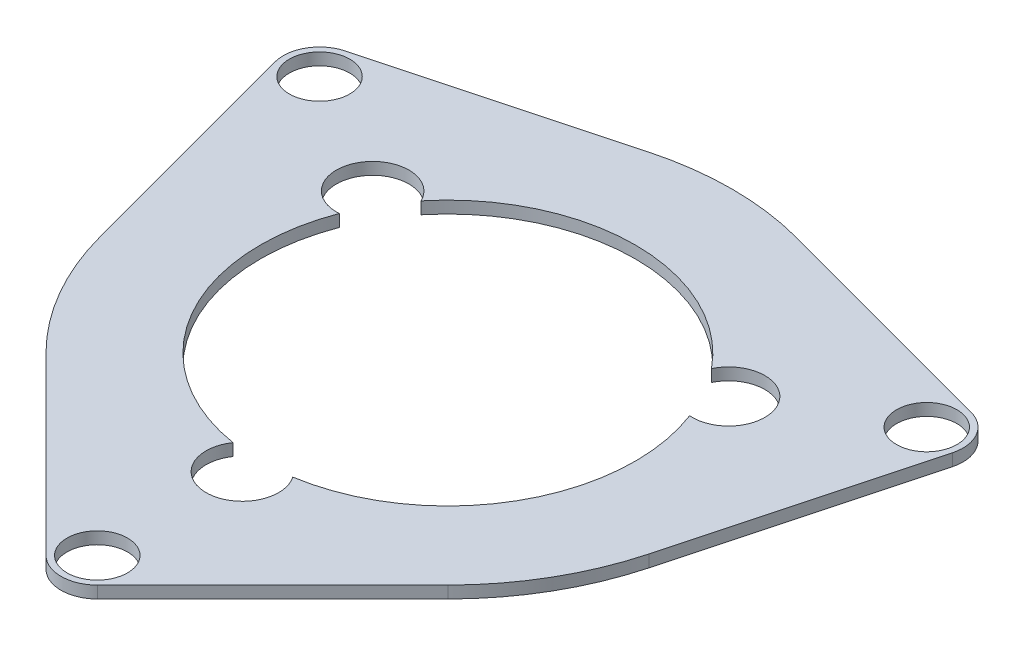
ISO-10303-21;
HEADER;
FILE_DESCRIPTION(('STEP AP214'),'2;1');
FILE_NAME('part.step','',(''),(''),'','','');
FILE_SCHEMA(('AUTOMOTIVE_DESIGN { 1 0 10303 214 1 1 1 1 }'));
ENDSEC;
DATA;
#1=APPLICATION_CONTEXT('core data for automotive mechanical design processes');
#2=APPLICATION_PROTOCOL_DEFINITION('international standard','automotive_design',2000,#1);
#3=PRODUCT_CONTEXT('',#1,'mechanical');
#4=PRODUCT('Part','Part','',(#3));
#5=PRODUCT_RELATED_PRODUCT_CATEGORY('part','',(#4));
#6=PRODUCT_DEFINITION_FORMATION('','',#4);
#7=PRODUCT_DEFINITION_CONTEXT('part definition',#1,'design');
#8=PRODUCT_DEFINITION('design','',#6,#7);
#9=PRODUCT_DEFINITION_SHAPE('','',#8);
#10=(LENGTH_UNIT() NAMED_UNIT(*) SI_UNIT(.MILLI.,.METRE.));
#11=(NAMED_UNIT(*) PLANE_ANGLE_UNIT() SI_UNIT($,.RADIAN.));
#12=(NAMED_UNIT(*) SI_UNIT($,.STERADIAN.) SOLID_ANGLE_UNIT());
#13=UNCERTAINTY_MEASURE_WITH_UNIT(LENGTH_MEASURE(1.E-05),#10,'distance_accuracy_value','');
#14=(GEOMETRIC_REPRESENTATION_CONTEXT(3) GLOBAL_UNCERTAINTY_ASSIGNED_CONTEXT((#13)) GLOBAL_UNIT_ASSIGNED_CONTEXT((#10,
#11,#12)) REPRESENTATION_CONTEXT('',''));
#15=CARTESIAN_POINT('',(0.,0.,0.));
#16=DIRECTION('',(0.,0.,1.));
#17=DIRECTION('',(1.,0.,0.));
#18=AXIS2_PLACEMENT_3D('',#15,#16,#17);
#19=CARTESIAN_POINT('',(0.,0.5,0.));
#20=DIRECTION('',(0.,-1.,0.));
#21=DIRECTION('',(0.,0.,-1.));
#22=AXIS2_PLACEMENT_3D('',#19,#20,#21);
#23=PLANE('',#22);
#24=CARTESIAN_POINT('',(0.,0.5,14.4999999999999));
#25=DIRECTION('',(0.,1.,0.));
#26=DIRECTION('',(0.,0.,1.));
#27=AXIS2_PLACEMENT_3D('',#24,#25,#26);
#28=CIRCLE('',#27,1.25);
#29=CARTESIAN_POINT('',(0.,0.5,15.7499999999999));
#30=VERTEX_POINT('',#29);
#31=EDGE_CURVE('E206',#30,#30,#28,.T.);
#32=ORIENTED_EDGE('',*,*,#31,.F.);
#33=EDGE_LOOP('',(#32));
#34=FACE_BOUND('',#33,.T.);
#35=CARTESIAN_POINT('',(-12.5573683548744,0.5,-7.24999999999988));
#36=DIRECTION('',(0.,1.,0.));
#37=DIRECTION('',(0.,0.,1.));
#38=AXIS2_PLACEMENT_3D('',#35,#36,#37);
#39=CIRCLE('',#38,1.25);
#40=CARTESIAN_POINT('',(-12.5573683548744,0.5,-5.99999999999988));
#41=VERTEX_POINT('',#40);
#42=EDGE_CURVE('E218',#41,#41,#39,.T.);
#43=ORIENTED_EDGE('',*,*,#42,.F.);
#44=EDGE_LOOP('',(#43));
#45=FACE_BOUND('',#44,.T.);
#46=CARTESIAN_POINT('',(0.,0.5,0.));
#47=DIRECTION('',(0.,1.,0.));
#48=DIRECTION('',(0.,0.,-1.));
#49=AXIS2_PLACEMENT_3D('',#46,#47,#48);
#50=CIRCLE('',#49,11.753048327205);
#51=CARTESIAN_POINT('',(3.0419127450911,0.5,-11.3525729168708));
#52=VERTEX_POINT('',#51);
#53=CARTESIAN_POINT('',(-3.0419127450911,0.5,-11.3525729168708));
#54=VERTEX_POINT('',#53);
#55=EDGE_CURVE('E224',#52,#54,#50,.T.);
#56=ORIENTED_EDGE('',*,*,#55,.T.);
#57=DIRECTION('',(-0.965925826289065,0.,0.258819045102533));
#58=VECTOR('',#57,1.);
#59=CARTESIAN_POINT('',(-3.0419127450911,0.5,-11.3525729168708));
#60=LINE('',#59,#58);
#61=CARTESIAN_POINT('',(-12.9455969225282,0.5,-8.69888873943348));
#62=VERTEX_POINT('',#61);
#63=EDGE_CURVE('E227',#54,#62,#60,.T.);
#64=ORIENTED_EDGE('',*,*,#63,.T.);
#65=CARTESIAN_POINT('',(-12.5573683548744,0.5,-7.24999999999988));
#66=DIRECTION('',(0.,1.,0.));
#67=DIRECTION('',(0.,0.,-1.));
#68=AXIS2_PLACEMENT_3D('',#65,#66,#67);
#69=CIRCLE('',#68,1.5);
#70=CARTESIAN_POINT('',(-14.006257094308,0.5,-6.86177143234609));
#71=VERTEX_POINT('',#70);
#72=EDGE_CURVE('E230',#62,#71,#69,.T.);
#73=ORIENTED_EDGE('',*,*,#72,.T.);
#74=DIRECTION('',(0.258819045102528,0.,0.965925826289066));
#75=VECTOR('',#74,1.);
#76=CARTESIAN_POINT('',(-11.3525729168708,0.5,3.04191274509105));
#77=LINE('',#76,#75);
#78=CARTESIAN_POINT('',(-11.3525729168708,0.5,3.04191274509105));
#79=VERTEX_POINT('',#78);
#80=EDGE_CURVE('E232',#71,#79,#77,.T.);
#81=ORIENTED_EDGE('',*,*,#80,.T.);
#82=CARTESIAN_POINT('',(0.,0.5,0.));
#83=DIRECTION('',(0.,1.,0.));
#84=DIRECTION('',(0.,0.,1.));
#85=AXIS2_PLACEMENT_3D('',#82,#83,#84);
#86=CIRCLE('',#85,11.753048327205);
#87=CARTESIAN_POINT('',(-8.31066017177983,0.5,8.31066017177985));
#88=VERTEX_POINT('',#87);
#89=EDGE_CURVE('E234',#79,#88,#86,.T.);
#90=ORIENTED_EDGE('',*,*,#89,.T.);
#91=DIRECTION('',(0.707106781186549,0.,0.707106781186546));
#92=VECTOR('',#91,1.);
#93=CARTESIAN_POINT('',(-8.31066017177982,0.5,8.31066017177985));
#94=LINE('',#93,#92);
#95=CARTESIAN_POINT('',(-1.06066017177982,0.5,15.5606601717798));
#96=VERTEX_POINT('',#95);
#97=EDGE_CURVE('E236',#88,#96,#94,.T.);
#98=ORIENTED_EDGE('',*,*,#97,.T.);
#99=CARTESIAN_POINT('',(0.,0.5,14.4999999999999));
#100=DIRECTION('',(0.,1.,0.));
#101=DIRECTION('',(0.,0.,1.));
#102=AXIS2_PLACEMENT_3D('',#99,#100,#101);
#103=CIRCLE('',#102,1.50000000000005);
#104=CARTESIAN_POINT('',(1.06066017177982,0.5,15.5606601717798));
#105=VERTEX_POINT('',#104);
#106=EDGE_CURVE('E238',#96,#105,#103,.T.);
#107=ORIENTED_EDGE('',*,*,#106,.T.);
#108=DIRECTION('',(0.707106781186548,0.,-0.707106781186547));
#109=VECTOR('',#108,1.);
#110=CARTESIAN_POINT('',(8.31066017177982,0.5,8.31066017177985));
#111=LINE('',#110,#109);
#112=CARTESIAN_POINT('',(8.31066017177982,0.5,8.31066017177985));
#113=VERTEX_POINT('',#112);
#114=EDGE_CURVE('E240',#105,#113,#111,.T.);
#115=ORIENTED_EDGE('',*,*,#114,.T.);
#116=CARTESIAN_POINT('',(0.,0.5,0.));
#117=DIRECTION('',(0.,1.,0.));
#118=DIRECTION('',(0.,0.,-1.));
#119=AXIS2_PLACEMENT_3D('',#116,#117,#118);
#120=CIRCLE('',#119,11.753048327205);
#121=CARTESIAN_POINT('',(11.3525729168708,0.5,3.04191274509105));
#122=VERTEX_POINT('',#121);
#123=EDGE_CURVE('E242',#113,#122,#120,.T.);
#124=ORIENTED_EDGE('',*,*,#123,.T.);
#125=DIRECTION('',(0.258819045102527,0.,-0.965925826289067));
#126=VECTOR('',#125,1.);
#127=CARTESIAN_POINT('',(11.3525729168708,0.5,3.04191274509105));
#128=LINE('',#127,#126);
#129=CARTESIAN_POINT('',(14.006257094308,0.5,-6.8617714323461));
#130=VERTEX_POINT('',#129);
#131=EDGE_CURVE('E244',#122,#130,#128,.T.);
#132=ORIENTED_EDGE('',*,*,#131,.T.);
#133=CARTESIAN_POINT('',(12.5573683548744,0.5,-7.24999999999991));
#134=DIRECTION('',(0.,1.,0.));
#135=DIRECTION('',(0.,0.,-1.));
#136=AXIS2_PLACEMENT_3D('',#133,#134,#135);
#137=CIRCLE('',#136,1.49999999999999);
#138=CARTESIAN_POINT('',(12.9455969225282,0.5,-8.69888873943349));
#139=VERTEX_POINT('',#138);
#140=EDGE_CURVE('E246',#130,#139,#137,.T.);
#141=ORIENTED_EDGE('',*,*,#140,.T.);
#142=DIRECTION('',(-0.965925826289065,0.,-0.258819045102532));
#143=VECTOR('',#142,1.);
#144=CARTESIAN_POINT('',(3.0419127450911,0.5,-11.3525729168708));
#145=LINE('',#144,#143);
#146=EDGE_CURVE('E248',#139,#52,#145,.T.);
#147=ORIENTED_EDGE('',*,*,#146,.T.);
#148=EDGE_LOOP('',(#56,#64,#73,#81,#90,#98,#107,#115,#124,#132,#141,#147));
#149=FACE_BOUND('',#148,.T.);
#150=CARTESIAN_POINT('',(12.5573683548744,0.5,-7.24999999999991));
#151=DIRECTION('',(0.,1.,0.));
#152=DIRECTION('',(0.,0.,1.));
#153=AXIS2_PLACEMENT_3D('',#150,#151,#152);
#154=CIRCLE('',#153,1.25);
#155=CARTESIAN_POINT('',(12.5573683548744,0.5,-5.99999999999991));
#156=VERTEX_POINT('',#155);
#157=EDGE_CURVE('E212',#156,#156,#154,.T.);
#158=ORIENTED_EDGE('',*,*,#157,.F.);
#159=EDGE_LOOP('',(#158));
#160=FACE_BOUND('',#159,.T.);
#161=CARTESIAN_POINT('',(0.,0.5,0.));
#162=DIRECTION('',(0.,1.,0.));
#163=DIRECTION('',(0.,0.,-1.));
#164=AXIS2_PLACEMENT_3D('',#161,#162,#163);
#165=CIRCLE('',#164,7.75);
#166=CARTESIAN_POINT('',(6.00751808071081,0.5,-4.89614404505553));
#167=VERTEX_POINT('',#166);
#168=CARTESIAN_POINT('',(-6.00751808071081,0.5,-4.89614404505553));
#169=VERTEX_POINT('',#168);
#170=EDGE_CURVE('E155',#167,#169,#165,.T.);
#171=ORIENTED_EDGE('',*,*,#170,.F.);
#172=CARTESIAN_POINT('',(7.36121593216777,0.5,-4.24999999999993));
#173=DIRECTION('',(0.,1.,0.));
#174=DIRECTION('',(0.,0.,-1.));
#175=AXIS2_PLACEMENT_3D('',#172,#173,#174);
#176=CIRCLE('',#175,1.5);
#177=CARTESIAN_POINT('',(7.24394416396144,0.5,-2.754591249062));
#178=VERTEX_POINT('',#177);
#179=EDGE_CURVE('E184',#178,#167,#176,.T.);
#180=ORIENTED_EDGE('',*,*,#179,.F.);
#181=CARTESIAN_POINT('',(0.,0.5,0.));
#182=DIRECTION('',(0.,1.,0.));
#183=DIRECTION('',(0.,0.,-1.));
#184=AXIS2_PLACEMENT_3D('',#181,#182,#183);
#185=CIRCLE('',#184,7.75);
#186=CARTESIAN_POINT('',(1.23642608325066,0.5,7.65073529411765));
#187=VERTEX_POINT('',#186);
#188=EDGE_CURVE('E182',#187,#178,#185,.T.);
#189=ORIENTED_EDGE('',*,*,#188,.F.);
#190=CARTESIAN_POINT('',(0.,0.5,8.5));
#191=DIRECTION('',(0.,1.,0.));
#192=DIRECTION('',(0.,0.,-1.));
#193=AXIS2_PLACEMENT_3D('',#190,#191,#192);
#194=CIRCLE('',#193,1.5);
#195=CARTESIAN_POINT('',(-1.23642608325065,0.5,7.65073529411765));
#196=VERTEX_POINT('',#195);
#197=EDGE_CURVE('E178',#196,#187,#194,.T.);
#198=ORIENTED_EDGE('',*,*,#197,.F.);
#199=CARTESIAN_POINT('',(0.,0.5,0.));
#200=DIRECTION('',(0.,1.,0.));
#201=DIRECTION('',(0.,0.,-1.));
#202=AXIS2_PLACEMENT_3D('',#199,#200,#201);
#203=CIRCLE('',#202,7.75);
#204=CARTESIAN_POINT('',(-7.24394416396144,0.5,-2.75459124906199));
#205=VERTEX_POINT('',#204);
#206=EDGE_CURVE('E176',#205,#196,#203,.T.);
#207=ORIENTED_EDGE('',*,*,#206,.F.);
#208=CARTESIAN_POINT('',(-7.36121593216777,0.5,-4.24999999999993));
#209=DIRECTION('',(0.,1.,0.));
#210=DIRECTION('',(0.,0.,-1.));
#211=AXIS2_PLACEMENT_3D('',#208,#209,#210);
#212=CIRCLE('',#211,1.5);
#213=EDGE_CURVE('E163',#169,#205,#212,.T.);
#214=ORIENTED_EDGE('',*,*,#213,.F.);
#215=EDGE_LOOP('',(#171,#180,#189,#198,#207,#214));
#216=FACE_BOUND('',#215,.T.);
#217=ADVANCED_FACE('F30',(#34,#45,#149,#160,#216),#23,.F.);
#218=CARTESIAN_POINT('',(0.,0.,0.));
#219=DIRECTION('',(0.,-1.,0.));
#220=DIRECTION('',(0.,0.,-1.));
#221=AXIS2_PLACEMENT_3D('',#218,#219,#220);
#222=PLANE('',#221);
#223=CARTESIAN_POINT('',(0.,0.,14.4999999999999));
#224=DIRECTION('',(0.,1.,0.));
#225=DIRECTION('',(0.,0.,1.));
#226=AXIS2_PLACEMENT_3D('',#223,#224,#225);
#227=CIRCLE('',#226,1.25);
#228=CARTESIAN_POINT('',(0.,0.,15.7499999999999));
#229=VERTEX_POINT('',#228);
#230=EDGE_CURVE('E171',#229,#229,#227,.T.);
#231=ORIENTED_EDGE('',*,*,#230,.T.);
#232=EDGE_LOOP('',(#231));
#233=FACE_BOUND('',#232,.T.);
#234=CARTESIAN_POINT('',(-12.5573683548744,0.,-7.24999999999988));
#235=DIRECTION('',(0.,1.,0.));
#236=DIRECTION('',(0.,0.,1.));
#237=AXIS2_PLACEMENT_3D('',#234,#235,#236);
#238=CIRCLE('',#237,1.25);
#239=CARTESIAN_POINT('',(-12.5573683548744,0.,-5.99999999999988));
#240=VERTEX_POINT('',#239);
#241=EDGE_CURVE('E215',#240,#240,#238,.T.);
#242=ORIENTED_EDGE('',*,*,#241,.T.);
#243=EDGE_LOOP('',(#242));
#244=FACE_BOUND('',#243,.T.);
#245=CARTESIAN_POINT('',(0.,0.,0.));
#246=DIRECTION('',(0.,1.,0.));
#247=DIRECTION('',(0.,0.,-1.));
#248=AXIS2_PLACEMENT_3D('',#245,#246,#247);
#249=CIRCLE('',#248,11.753048327205);
#250=CARTESIAN_POINT('',(3.0419127450911,0.,-11.3525729168708));
#251=VERTEX_POINT('',#250);
#252=CARTESIAN_POINT('',(-3.0419127450911,0.,-11.3525729168708));
#253=VERTEX_POINT('',#252);
#254=EDGE_CURVE('E221',#251,#253,#249,.T.);
#255=ORIENTED_EDGE('',*,*,#254,.F.);
#256=DIRECTION('',(-0.965925826289065,0.,-0.258819045102532));
#257=VECTOR('',#256,1.);
#258=CARTESIAN_POINT('',(3.0419127450911,0.,-11.3525729168708));
#259=LINE('',#258,#257);
#260=CARTESIAN_POINT('',(12.9455969225282,0.,-8.69888873943349));
#261=VERTEX_POINT('',#260);
#262=EDGE_CURVE('E228',#261,#251,#259,.T.);
#263=ORIENTED_EDGE('',*,*,#262,.F.);
#264=CARTESIAN_POINT('',(12.5573683548744,0.,-7.24999999999991));
#265=DIRECTION('',(0.,1.,0.));
#266=DIRECTION('',(0.,0.,-1.));
#267=AXIS2_PLACEMENT_3D('',#264,#265,#266);
#268=CIRCLE('',#267,1.49999999999999);
#269=CARTESIAN_POINT('',(14.006257094308,0.,-6.8617714323461));
#270=VERTEX_POINT('',#269);
#271=EDGE_CURVE('E271',#270,#261,#268,.T.);
#272=ORIENTED_EDGE('',*,*,#271,.F.);
#273=DIRECTION('',(0.258819045102527,0.,-0.965925826289067));
#274=VECTOR('',#273,1.);
#275=CARTESIAN_POINT('',(11.3525729168708,0.,3.04191274509105));
#276=LINE('',#275,#274);
#277=CARTESIAN_POINT('',(11.3525729168708,0.,3.04191274509105));
#278=VERTEX_POINT('',#277);
#279=EDGE_CURVE('E269',#278,#270,#276,.T.);
#280=ORIENTED_EDGE('',*,*,#279,.F.);
#281=CARTESIAN_POINT('',(0.,0.,0.));
#282=DIRECTION('',(0.,1.,0.));
#283=DIRECTION('',(0.,0.,-1.));
#284=AXIS2_PLACEMENT_3D('',#281,#282,#283);
#285=CIRCLE('',#284,11.753048327205);
#286=CARTESIAN_POINT('',(8.31066017177982,0.,8.31066017177985));
#287=VERTEX_POINT('',#286);
#288=EDGE_CURVE('E267',#287,#278,#285,.T.);
#289=ORIENTED_EDGE('',*,*,#288,.F.);
#290=DIRECTION('',(0.707106781186548,0.,-0.707106781186547));
#291=VECTOR('',#290,1.);
#292=CARTESIAN_POINT('',(8.31066017177982,0.,8.31066017177985));
#293=LINE('',#292,#291);
#294=CARTESIAN_POINT('',(1.06066017177982,0.,15.5606601717798));
#295=VERTEX_POINT('',#294);
#296=EDGE_CURVE('E265',#295,#287,#293,.T.);
#297=ORIENTED_EDGE('',*,*,#296,.F.);
#298=CARTESIAN_POINT('',(0.,0.,14.4999999999999));
#299=DIRECTION('',(0.,1.,0.));
#300=DIRECTION('',(0.,0.,1.));
#301=AXIS2_PLACEMENT_3D('',#298,#299,#300);
#302=CIRCLE('',#301,1.50000000000005);
#303=CARTESIAN_POINT('',(-1.06066017177982,0.,15.5606601717798));
#304=VERTEX_POINT('',#303);
#305=EDGE_CURVE('E263',#304,#295,#302,.T.);
#306=ORIENTED_EDGE('',*,*,#305,.F.);
#307=DIRECTION('',(0.707106781186549,0.,0.707106781186546));
#308=VECTOR('',#307,1.);
#309=CARTESIAN_POINT('',(-8.31066017177982,0.,8.31066017177985));
#310=LINE('',#309,#308);
#311=CARTESIAN_POINT('',(-8.31066017177983,0.,8.31066017177985));
#312=VERTEX_POINT('',#311);
#313=EDGE_CURVE('E261',#312,#304,#310,.T.);
#314=ORIENTED_EDGE('',*,*,#313,.F.);
#315=CARTESIAN_POINT('',(0.,0.,0.));
#316=DIRECTION('',(0.,1.,0.));
#317=DIRECTION('',(0.,0.,1.));
#318=AXIS2_PLACEMENT_3D('',#315,#316,#317);
#319=CIRCLE('',#318,11.753048327205);
#320=CARTESIAN_POINT('',(-11.3525729168708,0.,3.04191274509105));
#321=VERTEX_POINT('',#320);
#322=EDGE_CURVE('E259',#321,#312,#319,.T.);
#323=ORIENTED_EDGE('',*,*,#322,.F.);
#324=DIRECTION('',(0.258819045102528,0.,0.965925826289066));
#325=VECTOR('',#324,1.);
#326=CARTESIAN_POINT('',(-11.3525729168708,0.,3.04191274509105));
#327=LINE('',#326,#325);
#328=CARTESIAN_POINT('',(-14.006257094308,0.,-6.86177143234609));
#329=VERTEX_POINT('',#328);
#330=EDGE_CURVE('E257',#329,#321,#327,.T.);
#331=ORIENTED_EDGE('',*,*,#330,.F.);
#332=CARTESIAN_POINT('',(-12.5573683548744,0.,-7.24999999999988));
#333=DIRECTION('',(0.,1.,0.));
#334=DIRECTION('',(0.,0.,-1.));
#335=AXIS2_PLACEMENT_3D('',#332,#333,#334);
#336=CIRCLE('',#335,1.5);
#337=CARTESIAN_POINT('',(-12.9455969225282,0.,-8.69888873943348));
#338=VERTEX_POINT('',#337);
#339=EDGE_CURVE('E255',#338,#329,#336,.T.);
#340=ORIENTED_EDGE('',*,*,#339,.F.);
#341=DIRECTION('',(-0.965925826289065,0.,0.258819045102533));
#342=VECTOR('',#341,1.);
#343=CARTESIAN_POINT('',(-3.0419127450911,0.,-11.3525729168708));
#344=LINE('',#343,#342);
#345=EDGE_CURVE('E253',#253,#338,#344,.T.);
#346=ORIENTED_EDGE('',*,*,#345,.F.);
#347=EDGE_LOOP('',(#255,#263,#272,#280,#289,#297,#306,#314,#323,#331,#340,#346));
#348=FACE_BOUND('',#347,.T.);
#349=CARTESIAN_POINT('',(12.5573683548744,0.,-7.24999999999991));
#350=DIRECTION('',(0.,1.,0.));
#351=DIRECTION('',(0.,0.,1.));
#352=AXIS2_PLACEMENT_3D('',#349,#350,#351);
#353=CIRCLE('',#352,1.25);
#354=CARTESIAN_POINT('',(12.5573683548744,0.,-5.99999999999991));
#355=VERTEX_POINT('',#354);
#356=EDGE_CURVE('E209',#355,#355,#353,.T.);
#357=ORIENTED_EDGE('',*,*,#356,.T.);
#358=EDGE_LOOP('',(#357));
#359=FACE_BOUND('',#358,.T.);
#360=CARTESIAN_POINT('',(7.36121593216777,0.,-4.24999999999993));
#361=DIRECTION('',(0.,1.,0.));
#362=DIRECTION('',(0.,0.,-1.));
#363=AXIS2_PLACEMENT_3D('',#360,#361,#362);
#364=CIRCLE('',#363,1.5);
#365=CARTESIAN_POINT('',(7.24394416396144,0.,-2.754591249062));
#366=VERTEX_POINT('',#365);
#367=CARTESIAN_POINT('',(6.00751808071081,0.,-4.89614404505553));
#368=VERTEX_POINT('',#367);
#369=EDGE_CURVE('E164',#366,#368,#364,.T.);
#370=ORIENTED_EDGE('',*,*,#369,.T.);
#371=CARTESIAN_POINT('',(0.,0.,0.));
#372=DIRECTION('',(0.,1.,0.));
#373=DIRECTION('',(0.,0.,-1.));
#374=AXIS2_PLACEMENT_3D('',#371,#372,#373);
#375=CIRCLE('',#374,7.75);
#376=CARTESIAN_POINT('',(-6.00751808071081,0.,-4.89614404505553));
#377=VERTEX_POINT('',#376);
#378=EDGE_CURVE('E53',#368,#377,#375,.T.);
#379=ORIENTED_EDGE('',*,*,#378,.T.);
#380=CARTESIAN_POINT('',(-7.36121593216777,0.,-4.24999999999993));
#381=DIRECTION('',(0.,1.,0.));
#382=DIRECTION('',(0.,0.,-1.));
#383=AXIS2_PLACEMENT_3D('',#380,#381,#382);
#384=CIRCLE('',#383,1.5);
#385=CARTESIAN_POINT('',(-7.24394416396144,0.,-2.75459124906199));
#386=VERTEX_POINT('',#385);
#387=EDGE_CURVE('E170',#377,#386,#384,.T.);
#388=ORIENTED_EDGE('',*,*,#387,.T.);
#389=CARTESIAN_POINT('',(0.,0.,0.));
#390=DIRECTION('',(0.,1.,0.));
#391=DIRECTION('',(0.,0.,-1.));
#392=AXIS2_PLACEMENT_3D('',#389,#390,#391);
#393=CIRCLE('',#392,7.75);
#394=CARTESIAN_POINT('',(-1.23642608325065,0.,7.65073529411765));
#395=VERTEX_POINT('',#394);
#396=EDGE_CURVE('E188',#386,#395,#393,.T.);
#397=ORIENTED_EDGE('',*,*,#396,.T.);
#398=CARTESIAN_POINT('',(0.,0.,8.5));
#399=DIRECTION('',(0.,1.,0.));
#400=DIRECTION('',(0.,0.,-1.));
#401=AXIS2_PLACEMENT_3D('',#398,#399,#400);
#402=CIRCLE('',#401,1.5);
#403=CARTESIAN_POINT('',(1.23642608325066,0.,7.65073529411765));
#404=VERTEX_POINT('',#403);
#405=EDGE_CURVE('E191',#395,#404,#402,.T.);
#406=ORIENTED_EDGE('',*,*,#405,.T.);
#407=CARTESIAN_POINT('',(0.,0.,0.));
#408=DIRECTION('',(0.,1.,0.));
#409=DIRECTION('',(0.,0.,-1.));
#410=AXIS2_PLACEMENT_3D('',#407,#408,#409);
#411=CIRCLE('',#410,7.75);
#412=EDGE_CURVE('E194',#404,#366,#411,.T.);
#413=ORIENTED_EDGE('',*,*,#412,.T.);
#414=EDGE_LOOP('',(#370,#379,#388,#397,#406,#413));
#415=FACE_BOUND('',#414,.T.);
#416=ADVANCED_FACE('F313',(#233,#244,#348,#359,#415),#222,.T.);
#417=CARTESIAN_POINT('',(0.,0.5,0.));
#418=DIRECTION('',(0.,-1.,0.));
#419=DIRECTION('',(0.,0.,-1.));
#420=AXIS2_PLACEMENT_3D('',#417,#418,#419);
#421=CYLINDRICAL_SURFACE('',#420,11.753048327205);
#422=ORIENTED_EDGE('',*,*,#254,.T.);
#423=DIRECTION('',(0.,-1.,0.));
#424=VECTOR('',#423,1.);
#425=CARTESIAN_POINT('',(-3.0419127450911,0.5,-11.3525729168708));
#426=LINE('',#425,#424);
#427=EDGE_CURVE('E11',#54,#253,#426,.T.);
#428=ORIENTED_EDGE('',*,*,#427,.F.);
#429=ORIENTED_EDGE('',*,*,#55,.F.);
#430=DIRECTION('',(0.,-1.,0.));
#431=VECTOR('',#430,1.);
#432=CARTESIAN_POINT('',(3.0419127450911,0.5,-11.3525729168708));
#433=LINE('',#432,#431);
#434=EDGE_CURVE('E250',#52,#251,#433,.T.);
#435=ORIENTED_EDGE('',*,*,#434,.T.);
#436=EDGE_LOOP('',(#422,#428,#429,#435));
#437=FACE_BOUND('',#436,.T.);
#438=ADVANCED_FACE('F32',(#437),#421,.T.);
#439=CARTESIAN_POINT('',(-3.0419127450911,0.5,-11.3525729168708));
#440=DIRECTION('',(0.258819045102533,0.,0.965925826289065));
#441=DIRECTION('',(0.965925826289065,0.,-0.258819045102533));
#442=AXIS2_PLACEMENT_3D('',#439,#440,#441);
#443=PLANE('',#442);
#444=ORIENTED_EDGE('',*,*,#345,.T.);
#445=DIRECTION('',(0.,-1.,0.));
#446=VECTOR('',#445,1.);
#447=CARTESIAN_POINT('',(-12.9455969225282,0.5,-8.69888873943348));
#448=LINE('',#447,#446);
#449=EDGE_CURVE('E38',#62,#338,#448,.T.);
#450=ORIENTED_EDGE('',*,*,#449,.F.);
#451=ORIENTED_EDGE('',*,*,#63,.F.);
#452=ORIENTED_EDGE('',*,*,#427,.T.);
#453=EDGE_LOOP('',(#444,#450,#451,#452));
#454=FACE_BOUND('',#453,.T.);
#455=ADVANCED_FACE('F331',(#454),#443,.F.);
#456=CARTESIAN_POINT('',(-12.5573683548744,0.5,-7.24999999999988));
#457=DIRECTION('',(0.,-1.,0.));
#458=DIRECTION('',(0.,0.,-1.));
#459=AXIS2_PLACEMENT_3D('',#456,#457,#458);
#460=CYLINDRICAL_SURFACE('',#459,1.5);
#461=ORIENTED_EDGE('',*,*,#339,.T.);
#462=DIRECTION('',(0.,-1.,0.));
#463=VECTOR('',#462,1.);
#464=CARTESIAN_POINT('',(-14.006257094308,0.5,-6.86177143234609));
#465=LINE('',#464,#463);
#466=EDGE_CURVE('E300',#71,#329,#465,.T.);
#467=ORIENTED_EDGE('',*,*,#466,.F.);
#468=ORIENTED_EDGE('',*,*,#72,.F.);
#469=ORIENTED_EDGE('',*,*,#449,.T.);
#470=EDGE_LOOP('',(#461,#467,#468,#469));
#471=FACE_BOUND('',#470,.T.);
#472=ADVANCED_FACE('F307',(#471),#460,.T.);
#473=CARTESIAN_POINT('',(-11.3525729168708,0.5,3.04191274509105));
#474=DIRECTION('',(0.965925826289067,0.,-0.258819045102528));
#475=DIRECTION('',(-0.258819045102528,0.,-0.965925826289067));
#476=AXIS2_PLACEMENT_3D('',#473,#474,#475);
#477=PLANE('',#476);
#478=ORIENTED_EDGE('',*,*,#330,.T.);
#479=DIRECTION('',(0.,-1.,0.));
#480=VECTOR('',#479,1.);
#481=CARTESIAN_POINT('',(-11.3525729168708,0.5,3.04191274509105));
#482=LINE('',#481,#480);
#483=EDGE_CURVE('E297',#79,#321,#482,.T.);
#484=ORIENTED_EDGE('',*,*,#483,.F.);
#485=ORIENTED_EDGE('',*,*,#80,.F.);
#486=ORIENTED_EDGE('',*,*,#466,.T.);
#487=EDGE_LOOP('',(#478,#484,#485,#486));
#488=FACE_BOUND('',#487,.T.);
#489=ADVANCED_FACE('F319',(#488),#477,.F.);
#490=CARTESIAN_POINT('',(0.,0.5,0.));
#491=DIRECTION('',(0.,-1.,0.));
#492=DIRECTION('',(0.,0.,-1.));
#493=AXIS2_PLACEMENT_3D('',#490,#491,#492);
#494=CYLINDRICAL_SURFACE('',#493,11.753048327205);
#495=ORIENTED_EDGE('',*,*,#322,.T.);
#496=DIRECTION('',(0.,-1.,0.));
#497=VECTOR('',#496,1.);
#498=CARTESIAN_POINT('',(-8.31066017177983,0.5,8.31066017177985));
#499=LINE('',#498,#497);
#500=EDGE_CURVE('E294',#88,#312,#499,.T.);
#501=ORIENTED_EDGE('',*,*,#500,.F.);
#502=ORIENTED_EDGE('',*,*,#89,.F.);
#503=ORIENTED_EDGE('',*,*,#483,.T.);
#504=EDGE_LOOP('',(#495,#501,#502,#503));
#505=FACE_BOUND('',#504,.T.);
#506=ADVANCED_FACE('F323',(#505),#494,.T.);
#507=CARTESIAN_POINT('',(-8.31066017177982,0.5,8.31066017177985));
#508=DIRECTION('',(0.707106781186546,0.,-0.707106781186549));
#509=DIRECTION('',(-0.707106781186549,0.,-0.707106781186546));
#510=AXIS2_PLACEMENT_3D('',#507,#508,#509);
#511=PLANE('',#510);
#512=ORIENTED_EDGE('',*,*,#313,.T.);
#513=DIRECTION('',(0.,-1.,0.));
#514=VECTOR('',#513,1.);
#515=CARTESIAN_POINT('',(-1.06066017177982,0.5,15.5606601717798));
#516=LINE('',#515,#514);
#517=EDGE_CURVE('E291',#96,#304,#516,.T.);
#518=ORIENTED_EDGE('',*,*,#517,.F.);
#519=ORIENTED_EDGE('',*,*,#97,.F.);
#520=ORIENTED_EDGE('',*,*,#500,.T.);
#521=EDGE_LOOP('',(#512,#518,#519,#520));
#522=FACE_BOUND('',#521,.T.);
#523=ADVANCED_FACE('F364',(#522),#511,.F.);
#524=CARTESIAN_POINT('',(0.,0.5,14.4999999999999));
#525=DIRECTION('',(0.,-1.,0.));
#526=DIRECTION('',(0.,0.,-1.));
#527=AXIS2_PLACEMENT_3D('',#524,#525,#526);
#528=CYLINDRICAL_SURFACE('',#527,1.50000000000005);
#529=ORIENTED_EDGE('',*,*,#305,.T.);
#530=DIRECTION('',(0.,-1.,0.));
#531=VECTOR('',#530,1.);
#532=CARTESIAN_POINT('',(1.06066017177982,0.5,15.5606601717798));
#533=LINE('',#532,#531);
#534=EDGE_CURVE('E288',#105,#295,#533,.T.);
#535=ORIENTED_EDGE('',*,*,#534,.F.);
#536=ORIENTED_EDGE('',*,*,#106,.F.);
#537=ORIENTED_EDGE('',*,*,#517,.T.);
#538=EDGE_LOOP('',(#529,#535,#536,#537));
#539=FACE_BOUND('',#538,.T.);
#540=ADVANCED_FACE('F362',(#539),#528,.T.);
#541=CARTESIAN_POINT('',(8.31066017177982,0.5,8.31066017177985));
#542=DIRECTION('',(-0.707106781186547,0.,-0.707106781186548));
#543=DIRECTION('',(-0.707106781186548,0.,0.707106781186547));
#544=AXIS2_PLACEMENT_3D('',#541,#542,#543);
#545=PLANE('',#544);
#546=ORIENTED_EDGE('',*,*,#296,.T.);
#547=DIRECTION('',(0.,-1.,0.));
#548=VECTOR('',#547,1.);
#549=CARTESIAN_POINT('',(8.31066017177982,0.5,8.31066017177985));
#550=LINE('',#549,#548);
#551=EDGE_CURVE('E285',#113,#287,#550,.T.);
#552=ORIENTED_EDGE('',*,*,#551,.F.);
#553=ORIENTED_EDGE('',*,*,#114,.F.);
#554=ORIENTED_EDGE('',*,*,#534,.T.);
#555=EDGE_LOOP('',(#546,#552,#553,#554));
#556=FACE_BOUND('',#555,.T.);
#557=ADVANCED_FACE('F358',(#556),#545,.F.);
#558=CARTESIAN_POINT('',(0.,0.5,0.));
#559=DIRECTION('',(0.,-1.,0.));
#560=DIRECTION('',(0.,0.,-1.));
#561=AXIS2_PLACEMENT_3D('',#558,#559,#560);
#562=CYLINDRICAL_SURFACE('',#561,11.753048327205);
#563=ORIENTED_EDGE('',*,*,#288,.T.);
#564=DIRECTION('',(0.,-1.,0.));
#565=VECTOR('',#564,1.);
#566=CARTESIAN_POINT('',(11.3525729168708,0.5,3.04191274509105));
#567=LINE('',#566,#565);
#568=EDGE_CURVE('E282',#122,#278,#567,.T.);
#569=ORIENTED_EDGE('',*,*,#568,.F.);
#570=ORIENTED_EDGE('',*,*,#123,.F.);
#571=ORIENTED_EDGE('',*,*,#551,.T.);
#572=EDGE_LOOP('',(#563,#569,#570,#571));
#573=FACE_BOUND('',#572,.T.);
#574=ADVANCED_FACE('F353',(#573),#562,.T.);
#575=CARTESIAN_POINT('',(11.3525729168708,0.5,3.04191274509105));
#576=DIRECTION('',(-0.965925826289066,0.,-0.258819045102527));
#577=DIRECTION('',(-0.258819045102527,0.,0.965925826289067));
#578=AXIS2_PLACEMENT_3D('',#575,#576,#577);
#579=PLANE('',#578);
#580=ORIENTED_EDGE('',*,*,#279,.T.);
#581=DIRECTION('',(0.,-1.,0.));
#582=VECTOR('',#581,1.);
#583=CARTESIAN_POINT('',(14.006257094308,0.5,-6.8617714323461));
#584=LINE('',#583,#582);
#585=EDGE_CURVE('E279',#130,#270,#584,.T.);
#586=ORIENTED_EDGE('',*,*,#585,.F.);
#587=ORIENTED_EDGE('',*,*,#131,.F.);
#588=ORIENTED_EDGE('',*,*,#568,.T.);
#589=EDGE_LOOP('',(#580,#586,#587,#588));
#590=FACE_BOUND('',#589,.T.);
#591=ADVANCED_FACE('F347',(#590),#579,.F.);
#592=CARTESIAN_POINT('',(12.5573683548744,0.5,-7.24999999999991));
#593=DIRECTION('',(0.,-1.,0.));
#594=DIRECTION('',(0.,0.,-1.));
#595=AXIS2_PLACEMENT_3D('',#592,#593,#594);
#596=CYLINDRICAL_SURFACE('',#595,1.49999999999999);
#597=ORIENTED_EDGE('',*,*,#271,.T.);
#598=DIRECTION('',(0.,-1.,0.));
#599=VECTOR('',#598,1.);
#600=CARTESIAN_POINT('',(12.9455969225282,0.5,-8.69888873943349));
#601=LINE('',#600,#599);
#602=EDGE_CURVE('E276',#139,#261,#601,.T.);
#603=ORIENTED_EDGE('',*,*,#602,.F.);
#604=ORIENTED_EDGE('',*,*,#140,.F.);
#605=ORIENTED_EDGE('',*,*,#585,.T.);
#606=EDGE_LOOP('',(#597,#603,#604,#605));
#607=FACE_BOUND('',#606,.T.);
#608=ADVANCED_FACE('F343',(#607),#596,.T.);
#609=CARTESIAN_POINT('',(3.0419127450911,0.5,-11.3525729168708));
#610=DIRECTION('',(-0.258819045102532,0.,0.965925826289065));
#611=DIRECTION('',(0.965925826289065,0.,0.258819045102532));
#612=AXIS2_PLACEMENT_3D('',#609,#610,#611);
#613=PLANE('',#612);
#614=ORIENTED_EDGE('',*,*,#262,.T.);
#615=ORIENTED_EDGE('',*,*,#434,.F.);
#616=ORIENTED_EDGE('',*,*,#146,.F.);
#617=ORIENTED_EDGE('',*,*,#602,.T.);
#618=EDGE_LOOP('',(#614,#615,#616,#617));
#619=FACE_BOUND('',#618,.T.);
#620=ADVANCED_FACE('F338',(#619),#613,.F.);
#621=CARTESIAN_POINT('',(-12.5573683548744,0.5,-7.24999999999988));
#622=DIRECTION('',(0.,-1.,0.));
#623=DIRECTION('',(0.,0.,-1.));
#624=AXIS2_PLACEMENT_3D('',#621,#622,#623);
#625=CYLINDRICAL_SURFACE('',#624,1.25);
#626=ORIENTED_EDGE('',*,*,#42,.T.);
#627=EDGE_LOOP('',(#626));
#628=FACE_BOUND('',#627,.T.);
#629=ORIENTED_EDGE('',*,*,#241,.F.);
#630=EDGE_LOOP('',(#629));
#631=FACE_BOUND('',#630,.T.);
#632=ADVANCED_FACE('F384',(#628,#631),#625,.F.);
#633=CARTESIAN_POINT('',(12.5573683548744,0.5,-7.24999999999991));
#634=DIRECTION('',(0.,-1.,0.));
#635=DIRECTION('',(0.,0.,-1.));
#636=AXIS2_PLACEMENT_3D('',#633,#634,#635);
#637=CYLINDRICAL_SURFACE('',#636,1.25);
#638=ORIENTED_EDGE('',*,*,#157,.T.);
#639=EDGE_LOOP('',(#638));
#640=FACE_BOUND('',#639,.T.);
#641=ORIENTED_EDGE('',*,*,#356,.F.);
#642=EDGE_LOOP('',(#641));
#643=FACE_BOUND('',#642,.T.);
#644=ADVANCED_FACE('F422',(#640,#643),#637,.F.);
#645=CARTESIAN_POINT('',(0.,0.5,14.4999999999999));
#646=DIRECTION('',(0.,-1.,0.));
#647=DIRECTION('',(0.,0.,-1.));
#648=AXIS2_PLACEMENT_3D('',#645,#646,#647);
#649=CYLINDRICAL_SURFACE('',#648,1.25);
#650=ORIENTED_EDGE('',*,*,#31,.T.);
#651=EDGE_LOOP('',(#650));
#652=FACE_BOUND('',#651,.T.);
#653=ORIENTED_EDGE('',*,*,#230,.F.);
#654=EDGE_LOOP('',(#653));
#655=FACE_BOUND('',#654,.T.);
#656=ADVANCED_FACE('F429',(#652,#655),#649,.F.);
#657=CARTESIAN_POINT('',(0.,0.5,0.));
#658=DIRECTION('',(0.,-1.,0.));
#659=DIRECTION('',(0.,0.,-1.));
#660=AXIS2_PLACEMENT_3D('',#657,#658,#659);
#661=CYLINDRICAL_SURFACE('',#660,7.75);
#662=ORIENTED_EDGE('',*,*,#378,.F.);
#663=DIRECTION('',(0.,-1.,0.));
#664=VECTOR('',#663,1.);
#665=CARTESIAN_POINT('',(6.00751808071081,0.5,-4.89614404505553));
#666=LINE('',#665,#664);
#667=EDGE_CURVE('E159',#167,#368,#666,.T.);
#668=ORIENTED_EDGE('',*,*,#667,.F.);
#669=ORIENTED_EDGE('',*,*,#170,.T.);
#670=DIRECTION('',(0.,-1.,0.));
#671=VECTOR('',#670,1.);
#672=CARTESIAN_POINT('',(-6.00751808071081,0.5,-4.89614404505553));
#673=LINE('',#672,#671);
#674=EDGE_CURVE('E158',#169,#377,#673,.T.);
#675=ORIENTED_EDGE('',*,*,#674,.T.);
#676=EDGE_LOOP('',(#662,#668,#669,#675));
#677=FACE_BOUND('',#676,.T.);
#678=ADVANCED_FACE('F157',(#677),#661,.F.);
#679=CARTESIAN_POINT('',(-7.36121593216777,0.5,-4.24999999999993));
#680=DIRECTION('',(0.,-1.,0.));
#681=DIRECTION('',(0.,0.,-1.));
#682=AXIS2_PLACEMENT_3D('',#679,#680,#681);
#683=CYLINDRICAL_SURFACE('',#682,1.5);
#684=ORIENTED_EDGE('',*,*,#387,.F.);
#685=ORIENTED_EDGE('',*,*,#674,.F.);
#686=ORIENTED_EDGE('',*,*,#213,.T.);
#687=DIRECTION('',(0.,-1.,0.));
#688=VECTOR('',#687,1.);
#689=CARTESIAN_POINT('',(-7.24394416396144,0.5,-2.75459124906199));
#690=LINE('',#689,#688);
#691=EDGE_CURVE('E172',#205,#386,#690,.T.);
#692=ORIENTED_EDGE('',*,*,#691,.T.);
#693=EDGE_LOOP('',(#684,#685,#686,#692));
#694=FACE_BOUND('',#693,.T.);
#695=ADVANCED_FACE('F167',(#694),#683,.F.);
#696=CARTESIAN_POINT('',(0.,0.5,0.));
#697=DIRECTION('',(0.,-1.,0.));
#698=DIRECTION('',(0.,0.,-1.));
#699=AXIS2_PLACEMENT_3D('',#696,#697,#698);
#700=CYLINDRICAL_SURFACE('',#699,7.75);
#701=ORIENTED_EDGE('',*,*,#396,.F.);
#702=ORIENTED_EDGE('',*,*,#691,.F.);
#703=ORIENTED_EDGE('',*,*,#206,.T.);
#704=DIRECTION('',(0.,-1.,0.));
#705=VECTOR('',#704,1.);
#706=CARTESIAN_POINT('',(-1.23642608325065,0.5,7.65073529411765));
#707=LINE('',#706,#705);
#708=EDGE_CURVE('E203',#196,#395,#707,.T.);
#709=ORIENTED_EDGE('',*,*,#708,.T.);
#710=EDGE_LOOP('',(#701,#702,#703,#709));
#711=FACE_BOUND('',#710,.T.);
#712=ADVANCED_FACE('F449',(#711),#700,.F.);
#713=CARTESIAN_POINT('',(0.,0.5,8.5));
#714=DIRECTION('',(0.,-1.,0.));
#715=DIRECTION('',(0.,0.,-1.));
#716=AXIS2_PLACEMENT_3D('',#713,#714,#715);
#717=CYLINDRICAL_SURFACE('',#716,1.5);
#718=ORIENTED_EDGE('',*,*,#405,.F.);
#719=ORIENTED_EDGE('',*,*,#708,.F.);
#720=ORIENTED_EDGE('',*,*,#197,.T.);
#721=DIRECTION('',(0.,-1.,0.));
#722=VECTOR('',#721,1.);
#723=CARTESIAN_POINT('',(1.23642608325066,0.5,7.65073529411765));
#724=LINE('',#723,#722);
#725=EDGE_CURVE('E201',#187,#404,#724,.T.);
#726=ORIENTED_EDGE('',*,*,#725,.T.);
#727=EDGE_LOOP('',(#718,#719,#720,#726));
#728=FACE_BOUND('',#727,.T.);
#729=ADVANCED_FACE('F456',(#728),#717,.F.);
#730=CARTESIAN_POINT('',(0.,0.5,0.));
#731=DIRECTION('',(0.,-1.,0.));
#732=DIRECTION('',(0.,0.,-1.));
#733=AXIS2_PLACEMENT_3D('',#730,#731,#732);
#734=CYLINDRICAL_SURFACE('',#733,7.75);
#735=ORIENTED_EDGE('',*,*,#412,.F.);
#736=ORIENTED_EDGE('',*,*,#725,.F.);
#737=ORIENTED_EDGE('',*,*,#188,.T.);
#738=DIRECTION('',(0.,-1.,0.));
#739=VECTOR('',#738,1.);
#740=CARTESIAN_POINT('',(7.24394416396144,0.5,-2.754591249062));
#741=LINE('',#740,#739);
#742=EDGE_CURVE('E45',#178,#366,#741,.T.);
#743=ORIENTED_EDGE('',*,*,#742,.T.);
#744=EDGE_LOOP('',(#735,#736,#737,#743));
#745=FACE_BOUND('',#744,.T.);
#746=ADVANCED_FACE('F464',(#745),#734,.F.);
#747=CARTESIAN_POINT('',(7.36121593216777,0.5,-4.24999999999993));
#748=DIRECTION('',(0.,-1.,0.));
#749=DIRECTION('',(0.,0.,-1.));
#750=AXIS2_PLACEMENT_3D('',#747,#748,#749);
#751=CYLINDRICAL_SURFACE('',#750,1.5);
#752=ORIENTED_EDGE('',*,*,#369,.F.);
#753=ORIENTED_EDGE('',*,*,#742,.F.);
#754=ORIENTED_EDGE('',*,*,#179,.T.);
#755=ORIENTED_EDGE('',*,*,#667,.T.);
#756=EDGE_LOOP('',(#752,#753,#754,#755));
#757=FACE_BOUND('',#756,.T.);
#758=ADVANCED_FACE('F472',(#757),#751,.F.);
#759=CLOSED_SHELL('',(#217,#416,#438,#455,#472,#489,#506,#523,#540,#557,#574,#591,#608,#620,
#632,#644,#656,#678,#695,#712,#729,#746,#758));
#760=MANIFOLD_SOLID_BREP('B2',#759);
#761=ADVANCED_BREP_SHAPE_REPRESENTATION('',(#18,#760),#14);
#762=SHAPE_DEFINITION_REPRESENTATION(#9,#761);
ENDSEC;
END-ISO-10303-21;
